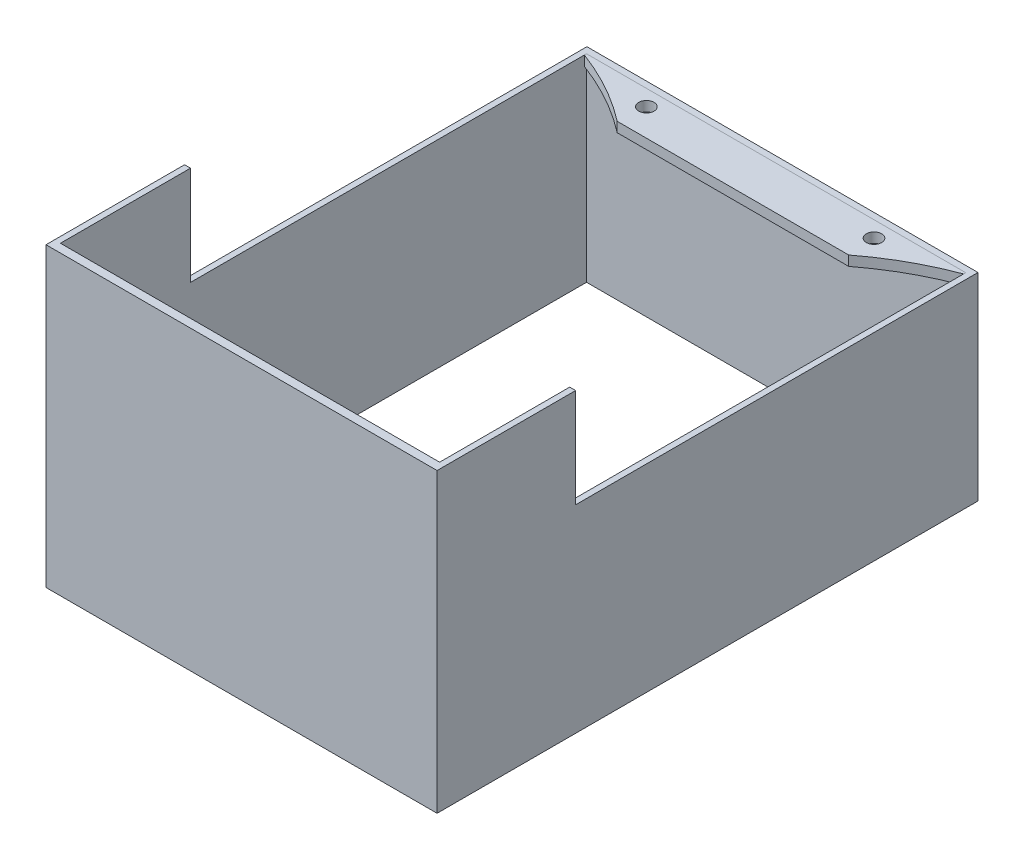
ISO-10303-21;
HEADER;
FILE_DESCRIPTION(('STEP AP214'),'2;1');
FILE_NAME('part.step','',(''),(''),'','','');
FILE_SCHEMA(('AUTOMOTIVE_DESIGN { 1 0 10303 214 1 1 1 1 }'));
ENDSEC;
DATA;
#1=APPLICATION_CONTEXT('core data for automotive mechanical design processes');
#2=APPLICATION_PROTOCOL_DEFINITION('international standard','automotive_design',2000,#1);
#3=PRODUCT_CONTEXT('',#1,'mechanical');
#4=PRODUCT('Part','Part','',(#3));
#5=PRODUCT_RELATED_PRODUCT_CATEGORY('part','',(#4));
#6=PRODUCT_DEFINITION_FORMATION('','',#4);
#7=PRODUCT_DEFINITION_CONTEXT('part definition',#1,'design');
#8=PRODUCT_DEFINITION('design','',#6,#7);
#9=PRODUCT_DEFINITION_SHAPE('','',#8);
#10=(LENGTH_UNIT() NAMED_UNIT(*) SI_UNIT(.MILLI.,.METRE.));
#11=(NAMED_UNIT(*) PLANE_ANGLE_UNIT() SI_UNIT($,.RADIAN.));
#12=(NAMED_UNIT(*) SI_UNIT($,.STERADIAN.) SOLID_ANGLE_UNIT());
#13=UNCERTAINTY_MEASURE_WITH_UNIT(LENGTH_MEASURE(1.E-05),#10,'distance_accuracy_value','');
#14=(GEOMETRIC_REPRESENTATION_CONTEXT(3) GLOBAL_UNCERTAINTY_ASSIGNED_CONTEXT((#13)) GLOBAL_UNIT_ASSIGNED_CONTEXT((#10,
#11,#12)) REPRESENTATION_CONTEXT('',''));
#15=CARTESIAN_POINT('',(0.,0.,0.));
#16=DIRECTION('',(0.,0.,1.));
#17=DIRECTION('',(1.,0.,0.));
#18=AXIS2_PLACEMENT_3D('',#15,#16,#17);
#19=CARTESIAN_POINT('',(-58.2500000000001,-8.,-8.5));
#20=DIRECTION('',(0.,0.,1.));
#21=DIRECTION('',(1.,0.,0.));
#22=AXIS2_PLACEMENT_3D('',#19,#20,#21);
#23=PLANE('',#22);
#24=DIRECTION('',(1.,0.,0.));
#25=VECTOR('',#24,1.);
#26=CARTESIAN_POINT('',(-58.2500000000001,2.,-8.5));
#27=LINE('',#26,#25);
#28=CARTESIAN_POINT('',(-39.52,2.,-8.50000000000001));
#29=VERTEX_POINT('',#28);
#30=CARTESIAN_POINT('',(39.52,2.,-8.50000000000001));
#31=VERTEX_POINT('',#30);
#32=EDGE_CURVE('E247',#29,#31,#27,.T.);
#33=ORIENTED_EDGE('',*,*,#32,.T.);
#34=DIRECTION('',(0.,1.,0.));
#35=VECTOR('',#34,1.);
#36=CARTESIAN_POINT('',(39.52,-8.,-8.50000000000001));
#37=LINE('',#36,#35);
#38=CARTESIAN_POINT('',(39.52,-38.,-8.50000000000001));
#39=VERTEX_POINT('',#38);
#40=EDGE_CURVE('E13',#39,#31,#37,.T.);
#41=ORIENTED_EDGE('',*,*,#40,.F.);
#42=DIRECTION('',(1.,0.,0.));
#43=VECTOR('',#42,1.);
#44=CARTESIAN_POINT('',(0.,-38.,-8.5));
#45=LINE('',#44,#43);
#46=CARTESIAN_POINT('',(-39.52,-38.,-8.50000000000001));
#47=VERTEX_POINT('',#46);
#48=EDGE_CURVE('E179',#47,#39,#45,.T.);
#49=ORIENTED_EDGE('',*,*,#48,.F.);
#50=DIRECTION('',(0.,1.,0.));
#51=VECTOR('',#50,1.);
#52=CARTESIAN_POINT('',(-39.52,-8.,-8.50000000000001));
#53=LINE('',#52,#51);
#54=EDGE_CURVE('E165',#47,#29,#53,.T.);
#55=ORIENTED_EDGE('',*,*,#54,.T.);
#56=EDGE_LOOP('',(#33,#41,#49,#55));
#57=FACE_BOUND('',#56,.T.);
#58=ADVANCED_FACE('F75',(#57),#23,.F.);
#59=CARTESIAN_POINT('',(39.52,-8.,46.4));
#60=DIRECTION('',(1.,0.,0.));
#61=DIRECTION('',(0.,0.,-1.));
#62=AXIS2_PLACEMENT_3D('',#59,#60,#61);
#63=PLANE('',#62);
#64=DIRECTION('',(0.,0.,-1.));
#65=VECTOR('',#64,1.);
#66=CARTESIAN_POINT('',(39.52,2.,46.4));
#67=LINE('',#66,#65);
#68=CARTESIAN_POINT('',(39.52,2.,72.8222176516292));
#69=VERTEX_POINT('',#68);
#70=EDGE_CURVE('E254',#69,#31,#67,.T.);
#71=ORIENTED_EDGE('',*,*,#70,.F.);
#72=DIRECTION('',(0.,-1.,0.));
#73=VECTOR('',#72,1.);
#74=CARTESIAN_POINT('',(39.52,22.,72.8222176516292));
#75=LINE('',#74,#73);
#76=CARTESIAN_POINT('',(39.52,22.,72.8222176516292));
#77=VERTEX_POINT('',#76);
#78=EDGE_CURVE('E89',#77,#69,#75,.T.);
#79=ORIENTED_EDGE('',*,*,#78,.F.);
#80=DIRECTION('',(0.,0.,-1.));
#81=VECTOR('',#80,1.);
#82=CARTESIAN_POINT('',(39.52,22.,0.));
#83=LINE('',#82,#81);
#84=CARTESIAN_POINT('',(39.52,22.,100.822217651629));
#85=VERTEX_POINT('',#84);
#86=EDGE_CURVE('E214',#85,#77,#83,.T.);
#87=ORIENTED_EDGE('',*,*,#86,.F.);
#88=DIRECTION('',(0.,1.,0.));
#89=VECTOR('',#88,1.);
#90=CARTESIAN_POINT('',(39.52,-8.,100.822217651629));
#91=LINE('',#90,#89);
#92=CARTESIAN_POINT('',(39.52,-38.,100.822217651629));
#93=VERTEX_POINT('',#92);
#94=EDGE_CURVE('E82',#93,#85,#91,.T.);
#95=ORIENTED_EDGE('',*,*,#94,.F.);
#96=DIRECTION('',(0.,0.,1.));
#97=VECTOR('',#96,1.);
#98=CARTESIAN_POINT('',(39.52,-38.,0.));
#99=LINE('',#98,#97);
#100=EDGE_CURVE('E183',#39,#93,#99,.T.);
#101=ORIENTED_EDGE('',*,*,#100,.F.);
#102=ORIENTED_EDGE('',*,*,#40,.T.);
#103=EDGE_LOOP('',(#71,#79,#87,#95,#101,#102));
#104=FACE_BOUND('',#103,.T.);
#105=ADVANCED_FACE('F267',(#104),#63,.T.);
#106=CARTESIAN_POINT('',(-58.2500000000001,-8.,100.822217651629));
#107=DIRECTION('',(0.,0.,-1.));
#108=DIRECTION('',(-1.,0.,0.));
#109=AXIS2_PLACEMENT_3D('',#106,#107,#108);
#110=PLANE('',#109);
#111=ORIENTED_EDGE('',*,*,#94,.T.);
#112=DIRECTION('',(1.,0.,0.));
#113=VECTOR('',#112,1.);
#114=CARTESIAN_POINT('',(0.,22.,100.822217651629));
#115=LINE('',#114,#113);
#116=CARTESIAN_POINT('',(-39.52,22.,100.822217651629));
#117=VERTEX_POINT('',#116);
#118=EDGE_CURVE('E210',#117,#85,#115,.T.);
#119=ORIENTED_EDGE('',*,*,#118,.F.);
#120=DIRECTION('',(0.,1.,0.));
#121=VECTOR('',#120,1.);
#122=CARTESIAN_POINT('',(-39.52,-8.,100.822217651629));
#123=LINE('',#122,#121);
#124=CARTESIAN_POINT('',(-39.52,-38.,100.822217651629));
#125=VERTEX_POINT('',#124);
#126=EDGE_CURVE('E176',#125,#117,#123,.T.);
#127=ORIENTED_EDGE('',*,*,#126,.F.);
#128=DIRECTION('',(-1.,0.,0.));
#129=VECTOR('',#128,1.);
#130=CARTESIAN_POINT('',(0.,-38.,100.822217651629));
#131=LINE('',#130,#129);
#132=EDGE_CURVE('E189',#93,#125,#131,.T.);
#133=ORIENTED_EDGE('',*,*,#132,.F.);
#134=EDGE_LOOP('',(#111,#119,#127,#133));
#135=FACE_BOUND('',#134,.T.);
#136=ADVANCED_FACE('F259',(#135),#110,.F.);
#137=CARTESIAN_POINT('',(-39.52,-8.,46.4));
#138=DIRECTION('',(1.,0.,0.));
#139=DIRECTION('',(0.,0.,-1.));
#140=AXIS2_PLACEMENT_3D('',#137,#138,#139);
#141=PLANE('',#140);
#142=ORIENTED_EDGE('',*,*,#126,.T.);
#143=DIRECTION('',(0.,0.,1.));
#144=VECTOR('',#143,1.);
#145=CARTESIAN_POINT('',(-39.52,22.,0.));
#146=LINE('',#145,#144);
#147=CARTESIAN_POINT('',(-39.52,22.,72.8222176516292));
#148=VERTEX_POINT('',#147);
#149=EDGE_CURVE('E207',#148,#117,#146,.T.);
#150=ORIENTED_EDGE('',*,*,#149,.F.);
#151=DIRECTION('',(0.,-1.,0.));
#152=VECTOR('',#151,1.);
#153=CARTESIAN_POINT('',(-39.52,22.,72.8222176516292));
#154=LINE('',#153,#152);
#155=CARTESIAN_POINT('',(-39.52,2.,72.8222176516292));
#156=VERTEX_POINT('',#155);
#157=EDGE_CURVE('E228',#148,#156,#154,.T.);
#158=ORIENTED_EDGE('',*,*,#157,.T.);
#159=DIRECTION('',(0.,0.,-1.));
#160=VECTOR('',#159,1.);
#161=CARTESIAN_POINT('',(-39.52,2.,46.4));
#162=LINE('',#161,#160);
#163=EDGE_CURVE('E172',#156,#29,#162,.T.);
#164=ORIENTED_EDGE('',*,*,#163,.T.);
#165=ORIENTED_EDGE('',*,*,#54,.F.);
#166=DIRECTION('',(0.,0.,-1.));
#167=VECTOR('',#166,1.);
#168=CARTESIAN_POINT('',(-39.52,-38.,0.));
#169=LINE('',#168,#167);
#170=EDGE_CURVE('E169',#125,#47,#169,.T.);
#171=ORIENTED_EDGE('',*,*,#170,.F.);
#172=EDGE_LOOP('',(#142,#150,#158,#164,#165,#171));
#173=FACE_BOUND('',#172,.T.);
#174=ADVANCED_FACE('F167',(#173),#141,.F.);
#175=CARTESIAN_POINT('',(0.,2.,0.));
#176=DIRECTION('',(0.,1.,0.));
#177=DIRECTION('',(0.,0.,1.));
#178=AXIS2_PLACEMENT_3D('',#175,#176,#177);
#179=PLANE('',#178);
#180=DIRECTION('',(-1.,0.,0.));
#181=VECTOR('',#180,1.);
#182=CARTESIAN_POINT('',(0.,2.,72.8222176516292));
#183=LINE('',#182,#181);
#184=CARTESIAN_POINT('',(-38.32,2.,72.8222176516292));
#185=VERTEX_POINT('',#184);
#186=EDGE_CURVE('E211',#185,#156,#183,.T.);
#187=ORIENTED_EDGE('',*,*,#186,.F.);
#188=DIRECTION('',(0.,0.,1.));
#189=VECTOR('',#188,1.);
#190=CARTESIAN_POINT('',(-38.32,2.,46.4));
#191=LINE('',#190,#189);
#192=CARTESIAN_POINT('',(-38.32,2.,-7.22221765162924));
#193=VERTEX_POINT('',#192);
#194=EDGE_CURVE('E238',#193,#185,#191,.T.);
#195=ORIENTED_EDGE('',*,*,#194,.F.);
#196=DIRECTION('',(-1.,0.,0.));
#197=VECTOR('',#196,1.);
#198=CARTESIAN_POINT('',(-58.2500000000001,2.,-7.22221765162924));
#199=LINE('',#198,#197);
#200=CARTESIAN_POINT('',(38.32,2.,-7.22221765162924));
#201=VERTEX_POINT('',#200);
#202=EDGE_CURVE('E97',#201,#193,#199,.T.);
#203=ORIENTED_EDGE('',*,*,#202,.F.);
#204=DIRECTION('',(0.,0.,1.));
#205=VECTOR('',#204,1.);
#206=CARTESIAN_POINT('',(38.32,2.,46.4));
#207=LINE('',#206,#205);
#208=CARTESIAN_POINT('',(38.32,2.,72.8222176516292));
#209=VERTEX_POINT('',#208);
#210=EDGE_CURVE('E241',#201,#209,#207,.T.);
#211=ORIENTED_EDGE('',*,*,#210,.T.);
#212=DIRECTION('',(1.,0.,0.));
#213=VECTOR('',#212,1.);
#214=CARTESIAN_POINT('',(0.,2.,72.8222176516292));
#215=LINE('',#214,#213);
#216=EDGE_CURVE('E206',#209,#69,#215,.T.);
#217=ORIENTED_EDGE('',*,*,#216,.T.);
#218=ORIENTED_EDGE('',*,*,#70,.T.);
#219=ORIENTED_EDGE('',*,*,#32,.F.);
#220=ORIENTED_EDGE('',*,*,#163,.F.);
#221=EDGE_LOOP('',(#187,#195,#203,#211,#217,#218,#219,#220));
#222=FACE_BOUND('',#221,.T.);
#223=ADVANCED_FACE('F287',(#222),#179,.T.);
#224=CARTESIAN_POINT('',(-58.2500000000001,-8.,-7.22221765162924));
#225=DIRECTION('',(0.,0.,-1.));
#226=DIRECTION('',(-1.,0.,0.));
#227=AXIS2_PLACEMENT_3D('',#224,#225,#226);
#228=PLANE('',#227);
#229=ORIENTED_EDGE('',*,*,#202,.T.);
#230=DIRECTION('',(0.,1.,0.));
#231=VECTOR('',#230,1.);
#232=CARTESIAN_POINT('',(-38.32,-8.,-7.22221765162924));
#233=LINE('',#232,#231);
#234=CARTESIAN_POINT('',(-38.32,-38.,-7.22221765162924));
#235=VERTEX_POINT('',#234);
#236=EDGE_CURVE('E244',#235,#193,#233,.T.);
#237=ORIENTED_EDGE('',*,*,#236,.F.);
#238=DIRECTION('',(-1.,0.,0.));
#239=VECTOR('',#238,1.);
#240=CARTESIAN_POINT('',(0.,-38.,-7.22221765162924));
#241=LINE('',#240,#239);
#242=CARTESIAN_POINT('',(38.32,-38.,-7.22221765162924));
#243=VERTEX_POINT('',#242);
#244=EDGE_CURVE('E200',#243,#235,#241,.T.);
#245=ORIENTED_EDGE('',*,*,#244,.F.);
#246=DIRECTION('',(0.,1.,0.));
#247=VECTOR('',#246,1.);
#248=CARTESIAN_POINT('',(38.32,-8.,-7.22221765162924));
#249=LINE('',#248,#247);
#250=EDGE_CURVE('E245',#243,#201,#249,.T.);
#251=ORIENTED_EDGE('',*,*,#250,.T.);
#252=EDGE_LOOP('',(#229,#237,#245,#251));
#253=FACE_BOUND('',#252,.T.);
#254=ADVANCED_FACE('F282',(#253),#228,.F.);
#255=CARTESIAN_POINT('',(38.32,-8.,46.4));
#256=DIRECTION('',(-1.,0.,0.));
#257=DIRECTION('',(0.,0.,1.));
#258=AXIS2_PLACEMENT_3D('',#255,#256,#257);
#259=PLANE('',#258);
#260=ORIENTED_EDGE('',*,*,#210,.F.);
#261=ORIENTED_EDGE('',*,*,#250,.F.);
#262=DIRECTION('',(0.,0.,-1.));
#263=VECTOR('',#262,1.);
#264=CARTESIAN_POINT('',(38.32,-38.,0.));
#265=LINE('',#264,#263);
#266=CARTESIAN_POINT('',(38.32,-38.,99.1067873224881));
#267=VERTEX_POINT('',#266);
#268=EDGE_CURVE('E197',#267,#243,#265,.T.);
#269=ORIENTED_EDGE('',*,*,#268,.F.);
#270=DIRECTION('',(0.,1.,0.));
#271=VECTOR('',#270,1.);
#272=CARTESIAN_POINT('',(38.32,-8.,99.1067873224881));
#273=LINE('',#272,#271);
#274=CARTESIAN_POINT('',(38.32,22.,99.1067873224881));
#275=VERTEX_POINT('',#274);
#276=EDGE_CURVE('E248',#267,#275,#273,.T.);
#277=ORIENTED_EDGE('',*,*,#276,.T.);
#278=DIRECTION('',(0.,0.,1.));
#279=VECTOR('',#278,1.);
#280=CARTESIAN_POINT('',(38.32,22.,0.));
#281=LINE('',#280,#279);
#282=CARTESIAN_POINT('',(38.32,22.,72.8222176516292));
#283=VERTEX_POINT('',#282);
#284=EDGE_CURVE('E218',#283,#275,#281,.T.);
#285=ORIENTED_EDGE('',*,*,#284,.F.);
#286=DIRECTION('',(0.,-1.,0.));
#287=VECTOR('',#286,1.);
#288=CARTESIAN_POINT('',(38.32,22.,72.8222176516292));
#289=LINE('',#288,#287);
#290=EDGE_CURVE('E234',#283,#209,#289,.T.);
#291=ORIENTED_EDGE('',*,*,#290,.T.);
#292=EDGE_LOOP('',(#260,#261,#269,#277,#285,#291));
#293=FACE_BOUND('',#292,.T.);
#294=ADVANCED_FACE('F315',(#293),#259,.T.);
#295=CARTESIAN_POINT('',(-58.2500000000001,-8.,99.1067873224881));
#296=DIRECTION('',(0.,0.,-1.));
#297=DIRECTION('',(-1.,0.,0.));
#298=AXIS2_PLACEMENT_3D('',#295,#296,#297);
#299=PLANE('',#298);
#300=DIRECTION('',(0.,1.,0.));
#301=VECTOR('',#300,1.);
#302=CARTESIAN_POINT('',(-38.32,-8.,99.1067873224881));
#303=LINE('',#302,#301);
#304=CARTESIAN_POINT('',(-38.32,-38.,99.1067873224881));
#305=VERTEX_POINT('',#304);
#306=CARTESIAN_POINT('',(-38.32,22.,99.1067873224881));
#307=VERTEX_POINT('',#306);
#308=EDGE_CURVE('E250',#305,#307,#303,.T.);
#309=ORIENTED_EDGE('',*,*,#308,.T.);
#310=DIRECTION('',(-1.,0.,0.));
#311=VECTOR('',#310,1.);
#312=CARTESIAN_POINT('',(0.,22.,99.1067873224881));
#313=LINE('',#312,#311);
#314=EDGE_CURVE('E221',#275,#307,#313,.T.);
#315=ORIENTED_EDGE('',*,*,#314,.F.);
#316=ORIENTED_EDGE('',*,*,#276,.F.);
#317=DIRECTION('',(1.,0.,0.));
#318=VECTOR('',#317,1.);
#319=CARTESIAN_POINT('',(0.,-38.,99.1067873224881));
#320=LINE('',#319,#318);
#321=EDGE_CURVE('E194',#305,#267,#320,.T.);
#322=ORIENTED_EDGE('',*,*,#321,.F.);
#323=EDGE_LOOP('',(#309,#315,#316,#322));
#324=FACE_BOUND('',#323,.T.);
#325=ADVANCED_FACE('F274',(#324),#299,.T.);
#326=CARTESIAN_POINT('',(-38.32,-8.,46.4));
#327=DIRECTION('',(-1.,0.,0.));
#328=DIRECTION('',(0.,0.,1.));
#329=AXIS2_PLACEMENT_3D('',#326,#327,#328);
#330=PLANE('',#329);
#331=ORIENTED_EDGE('',*,*,#194,.T.);
#332=DIRECTION('',(0.,-1.,0.));
#333=VECTOR('',#332,1.);
#334=CARTESIAN_POINT('',(-38.32,22.,72.8222176516292));
#335=LINE('',#334,#333);
#336=CARTESIAN_POINT('',(-38.32,22.,72.8222176516292));
#337=VERTEX_POINT('',#336);
#338=EDGE_CURVE('E232',#337,#185,#335,.T.);
#339=ORIENTED_EDGE('',*,*,#338,.F.);
#340=DIRECTION('',(0.,0.,-1.));
#341=VECTOR('',#340,1.);
#342=CARTESIAN_POINT('',(-38.32,22.,0.));
#343=LINE('',#342,#341);
#344=EDGE_CURVE('E224',#307,#337,#343,.T.);
#345=ORIENTED_EDGE('',*,*,#344,.F.);
#346=ORIENTED_EDGE('',*,*,#308,.F.);
#347=DIRECTION('',(0.,0.,1.));
#348=VECTOR('',#347,1.);
#349=CARTESIAN_POINT('',(-38.32,-38.,0.));
#350=LINE('',#349,#348);
#351=EDGE_CURVE('E203',#235,#305,#350,.T.);
#352=ORIENTED_EDGE('',*,*,#351,.F.);
#353=ORIENTED_EDGE('',*,*,#236,.T.);
#354=EDGE_LOOP('',(#331,#339,#345,#346,#352,#353));
#355=FACE_BOUND('',#354,.T.);
#356=ADVANCED_FACE('F279',(#355),#330,.F.);
#357=CARTESIAN_POINT('',(0.,22.,72.8222176516292));
#358=DIRECTION('',(0.,0.,-1.));
#359=DIRECTION('',(-1.,0.,0.));
#360=AXIS2_PLACEMENT_3D('',#357,#358,#359);
#361=PLANE('',#360);
#362=ORIENTED_EDGE('',*,*,#216,.F.);
#363=ORIENTED_EDGE('',*,*,#290,.F.);
#364=DIRECTION('',(1.,0.,0.));
#365=VECTOR('',#364,1.);
#366=CARTESIAN_POINT('',(0.,22.,72.8222176516292));
#367=LINE('',#366,#365);
#368=EDGE_CURVE('E216',#283,#77,#367,.T.);
#369=ORIENTED_EDGE('',*,*,#368,.T.);
#370=ORIENTED_EDGE('',*,*,#78,.T.);
#371=EDGE_LOOP('',(#362,#363,#369,#370));
#372=FACE_BOUND('',#371,.T.);
#373=ADVANCED_FACE('F268',(#372),#361,.T.);
#374=CARTESIAN_POINT('',(0.,22.,72.8222176516292));
#375=DIRECTION('',(0.,0.,1.));
#376=DIRECTION('',(1.,0.,0.));
#377=AXIS2_PLACEMENT_3D('',#374,#375,#376);
#378=PLANE('',#377);
#379=ORIENTED_EDGE('',*,*,#186,.T.);
#380=ORIENTED_EDGE('',*,*,#157,.F.);
#381=DIRECTION('',(-1.,0.,0.));
#382=VECTOR('',#381,1.);
#383=CARTESIAN_POINT('',(0.,22.,72.8222176516292));
#384=LINE('',#383,#382);
#385=EDGE_CURVE('E226',#337,#148,#384,.T.);
#386=ORIENTED_EDGE('',*,*,#385,.F.);
#387=ORIENTED_EDGE('',*,*,#338,.T.);
#388=EDGE_LOOP('',(#379,#380,#386,#387));
#389=FACE_BOUND('',#388,.T.);
#390=ADVANCED_FACE('F290',(#389),#378,.F.);
#391=CARTESIAN_POINT('',(0.,22.,0.));
#392=DIRECTION('',(0.,1.,0.));
#393=DIRECTION('',(0.,0.,1.));
#394=AXIS2_PLACEMENT_3D('',#391,#392,#393);
#395=PLANE('',#394);
#396=ORIENTED_EDGE('',*,*,#149,.T.);
#397=ORIENTED_EDGE('',*,*,#118,.T.);
#398=ORIENTED_EDGE('',*,*,#86,.T.);
#399=ORIENTED_EDGE('',*,*,#368,.F.);
#400=ORIENTED_EDGE('',*,*,#284,.T.);
#401=ORIENTED_EDGE('',*,*,#314,.T.);
#402=ORIENTED_EDGE('',*,*,#344,.T.);
#403=ORIENTED_EDGE('',*,*,#385,.T.);
#404=EDGE_LOOP('',(#396,#397,#398,#399,#400,#401,#402,#403));
#405=FACE_BOUND('',#404,.T.);
#406=ADVANCED_FACE('F263',(#405),#395,.T.);
#407=CARTESIAN_POINT('',(0.,-38.,0.));
#408=DIRECTION('',(0.,-1.,0.));
#409=DIRECTION('',(0.,0.,-1.));
#410=AXIS2_PLACEMENT_3D('',#407,#408,#409);
#411=PLANE('',#410);
#412=ORIENTED_EDGE('',*,*,#170,.T.);
#413=ORIENTED_EDGE('',*,*,#48,.T.);
#414=ORIENTED_EDGE('',*,*,#100,.T.);
#415=ORIENTED_EDGE('',*,*,#132,.T.);
#416=EDGE_LOOP('',(#412,#413,#414,#415));
#417=FACE_BOUND('',#416,.T.);
#418=ORIENTED_EDGE('',*,*,#321,.T.);
#419=ORIENTED_EDGE('',*,*,#268,.T.);
#420=ORIENTED_EDGE('',*,*,#244,.T.);
#421=ORIENTED_EDGE('',*,*,#351,.T.);
#422=EDGE_LOOP('',(#418,#419,#420,#421));
#423=FACE_BOUND('',#422,.T.);
#424=ADVANCED_FACE('F186',(#417,#423),#411,.T.);
#425=CLOSED_SHELL('',(#58,#105,#136,#174,#223,#254,#294,#325,#356,#373,#390,#406,#424));
#426=MANIFOLD_SOLID_BREP('B2',#425);
#427=CARTESIAN_POINT('',(0.,2.,1.5));
#428=DIRECTION('',(0.,0.,-1.));
#429=DIRECTION('',(-1.,0.,0.));
#430=AXIS2_PLACEMENT_3D('',#427,#428,#429);
#431=PLANE('',#430);
#432=DIRECTION('',(1.,0.,0.));
#433=VECTOR('',#432,1.);
#434=CARTESIAN_POINT('',(0.,0.,1.5));
#435=LINE('',#434,#433);
#436=CARTESIAN_POINT('',(-23.3950805297993,0.,1.5));
#437=VERTEX_POINT('',#436);
#438=CARTESIAN_POINT('',(23.3950805297993,0.,1.5));
#439=VERTEX_POINT('',#438);
#440=EDGE_CURVE('E637',#437,#439,#435,.T.);
#441=ORIENTED_EDGE('',*,*,#440,.T.);
#442=DIRECTION('',(0.,-1.,0.));
#443=VECTOR('',#442,1.);
#444=CARTESIAN_POINT('',(23.3950805297993,2.,1.5));
#445=LINE('',#444,#443);
#446=CARTESIAN_POINT('',(23.3950805297993,2.,1.5));
#447=VERTEX_POINT('',#446);
#448=EDGE_CURVE('E73',#447,#439,#445,.T.);
#449=ORIENTED_EDGE('',*,*,#448,.F.);
#450=DIRECTION('',(1.,0.,0.));
#451=VECTOR('',#450,1.);
#452=CARTESIAN_POINT('',(0.,2.,1.5));
#453=LINE('',#452,#451);
#454=CARTESIAN_POINT('',(-23.3950805297993,2.,1.5));
#455=VERTEX_POINT('',#454);
#456=EDGE_CURVE('E805',#455,#447,#453,.T.);
#457=ORIENTED_EDGE('',*,*,#456,.F.);
#458=DIRECTION('',(0.,-1.,0.));
#459=VECTOR('',#458,1.);
#460=CARTESIAN_POINT('',(-23.3950805297993,2.,1.5));
#461=LINE('',#460,#459);
#462=EDGE_CURVE('E563',#455,#437,#461,.T.);
#463=ORIENTED_EDGE('',*,*,#462,.T.);
#464=EDGE_LOOP('',(#441,#449,#457,#463));
#465=FACE_BOUND('',#464,.T.);
#466=ADVANCED_FACE('F546',(#465),#431,.F.);
#467=CARTESIAN_POINT('',(58.32,2.,46.8));
#468=DIRECTION('',(0.,-1.,0.));
#469=DIRECTION('',(0.,0.,-1.));
#470=AXIS2_PLACEMENT_3D('',#467,#468,#469);
#471=CYLINDRICAL_SURFACE('',#470,57.2);
#472=CARTESIAN_POINT('',(58.32,0.,46.8));
#473=DIRECTION('',(0.,1.,0.));
#474=DIRECTION('',(0.,0.,1.));
#475=AXIS2_PLACEMENT_3D('',#472,#473,#474);
#476=CIRCLE('',#475,57.2);
#477=CARTESIAN_POINT('',(38.32,0.,-6.78955122036385));
#478=VERTEX_POINT('',#477);
#479=EDGE_CURVE('E639',#439,#478,#476,.F.);
#480=ORIENTED_EDGE('',*,*,#479,.T.);
#481=DIRECTION('',(0.,-1.,0.));
#482=VECTOR('',#481,1.);
#483=CARTESIAN_POINT('',(38.32,2.,-6.78955122036385));
#484=LINE('',#483,#482);
#485=CARTESIAN_POINT('',(38.32,2.,-6.78955122036385));
#486=VERTEX_POINT('',#485);
#487=EDGE_CURVE('E555',#486,#478,#484,.T.);
#488=ORIENTED_EDGE('',*,*,#487,.F.);
#489=CARTESIAN_POINT('',(58.32,2.,46.8));
#490=DIRECTION('',(0.,1.,0.));
#491=DIRECTION('',(0.,0.,1.));
#492=AXIS2_PLACEMENT_3D('',#489,#490,#491);
#493=CIRCLE('',#492,57.2);
#494=EDGE_CURVE('E595',#447,#486,#493,.F.);
#495=ORIENTED_EDGE('',*,*,#494,.F.);
#496=ORIENTED_EDGE('',*,*,#448,.T.);
#497=EDGE_LOOP('',(#480,#488,#495,#496));
#498=FACE_BOUND('',#497,.T.);
#499=ADVANCED_FACE('F673',(#498),#471,.F.);
#500=CARTESIAN_POINT('',(38.32,2.,0.));
#501=DIRECTION('',(-1.,0.,0.));
#502=DIRECTION('',(0.,0.,1.));
#503=AXIS2_PLACEMENT_3D('',#500,#501,#502);
#504=PLANE('',#503);
#505=DIRECTION('',(0.,0.,-1.));
#506=VECTOR('',#505,1.);
#507=CARTESIAN_POINT('',(38.32,0.,0.));
#508=LINE('',#507,#506);
#509=CARTESIAN_POINT('',(38.32,0.,-7.22221765162924));
#510=VERTEX_POINT('',#509);
#511=EDGE_CURVE('E641',#478,#510,#508,.T.);
#512=ORIENTED_EDGE('',*,*,#511,.T.);
#513=DIRECTION('',(0.,-1.,0.));
#514=VECTOR('',#513,1.);
#515=CARTESIAN_POINT('',(38.32,2.,-7.22221765162924));
#516=LINE('',#515,#514);
#517=CARTESIAN_POINT('',(38.32,2.,-7.22221765162924));
#518=VERTEX_POINT('',#517);
#519=EDGE_CURVE('E614',#518,#510,#516,.T.);
#520=ORIENTED_EDGE('',*,*,#519,.F.);
#521=DIRECTION('',(0.,0.,-1.));
#522=VECTOR('',#521,1.);
#523=CARTESIAN_POINT('',(38.32,2.,0.));
#524=LINE('',#523,#522);
#525=EDGE_CURVE('E622',#486,#518,#524,.T.);
#526=ORIENTED_EDGE('',*,*,#525,.F.);
#527=ORIENTED_EDGE('',*,*,#487,.T.);
#528=EDGE_LOOP('',(#512,#520,#526,#527));
#529=FACE_BOUND('',#528,.T.);
#530=ADVANCED_FACE('F656',(#529),#504,.F.);
#531=CARTESIAN_POINT('',(0.,2.,-7.22221765162924));
#532=DIRECTION('',(0.,0.,-1.));
#533=DIRECTION('',(-1.,0.,0.));
#534=AXIS2_PLACEMENT_3D('',#531,#532,#533);
#535=PLANE('',#534);
#536=DIRECTION('',(1.,0.,0.));
#537=VECTOR('',#536,1.);
#538=CARTESIAN_POINT('',(0.,0.,-7.22221765162924));
#539=LINE('',#538,#537);
#540=CARTESIAN_POINT('',(-38.32,0.,-7.22221765162924));
#541=VERTEX_POINT('',#540);
#542=EDGE_CURVE('E610',#541,#510,#539,.T.);
#543=ORIENTED_EDGE('',*,*,#542,.F.);
#544=DIRECTION('',(0.,-1.,0.));
#545=VECTOR('',#544,1.);
#546=CARTESIAN_POINT('',(-38.32,2.,-7.22221765162924));
#547=LINE('',#546,#545);
#548=CARTESIAN_POINT('',(-38.32,2.,-7.22221765162924));
#549=VERTEX_POINT('',#548);
#550=EDGE_CURVE('E605',#549,#541,#547,.T.);
#551=ORIENTED_EDGE('',*,*,#550,.F.);
#552=DIRECTION('',(1.,0.,0.));
#553=VECTOR('',#552,1.);
#554=CARTESIAN_POINT('',(0.,2.,-7.22221765162924));
#555=LINE('',#554,#553);
#556=EDGE_CURVE('E608',#549,#518,#555,.T.);
#557=ORIENTED_EDGE('',*,*,#556,.T.);
#558=ORIENTED_EDGE('',*,*,#519,.T.);
#559=EDGE_LOOP('',(#543,#551,#557,#558));
#560=FACE_BOUND('',#559,.T.);
#561=ADVANCED_FACE('F607',(#560),#535,.T.);
#562=CARTESIAN_POINT('',(-38.32,2.,0.));
#563=DIRECTION('',(-1.,0.,0.));
#564=DIRECTION('',(0.,0.,1.));
#565=AXIS2_PLACEMENT_3D('',#562,#563,#564);
#566=PLANE('',#565);
#567=DIRECTION('',(0.,0.,-1.));
#568=VECTOR('',#567,1.);
#569=CARTESIAN_POINT('',(-38.32,0.,0.));
#570=LINE('',#569,#568);
#571=CARTESIAN_POINT('',(-38.32,0.,-6.78955122036385));
#572=VERTEX_POINT('',#571);
#573=EDGE_CURVE('E645',#572,#541,#570,.T.);
#574=ORIENTED_EDGE('',*,*,#573,.F.);
#575=DIRECTION('',(0.,-1.,0.));
#576=VECTOR('',#575,1.);
#577=CARTESIAN_POINT('',(-38.32,2.,-6.78955122036385));
#578=LINE('',#577,#576);
#579=CARTESIAN_POINT('',(-38.32,2.,-6.78955122036385));
#580=VERTEX_POINT('',#579);
#581=EDGE_CURVE('E583',#580,#572,#578,.T.);
#582=ORIENTED_EDGE('',*,*,#581,.F.);
#583=DIRECTION('',(0.,0.,-1.));
#584=VECTOR('',#583,1.);
#585=CARTESIAN_POINT('',(-38.32,2.,0.));
#586=LINE('',#585,#584);
#587=EDGE_CURVE('E620',#580,#549,#586,.T.);
#588=ORIENTED_EDGE('',*,*,#587,.T.);
#589=ORIENTED_EDGE('',*,*,#550,.T.);
#590=EDGE_LOOP('',(#574,#582,#588,#589));
#591=FACE_BOUND('',#590,.T.);
#592=ADVANCED_FACE('F625',(#591),#566,.T.);
#593=CARTESIAN_POINT('',(23.,2.,-4.));
#594=DIRECTION('',(0.,-1.,0.));
#595=DIRECTION('',(0.,0.,-1.));
#596=AXIS2_PLACEMENT_3D('',#593,#594,#595);
#597=CYLINDRICAL_SURFACE('',#596,1.55);
#598=CARTESIAN_POINT('',(23.,2.,-4.));
#599=DIRECTION('',(0.,1.,0.));
#600=DIRECTION('',(0.,0.,1.));
#601=AXIS2_PLACEMENT_3D('',#598,#599,#600);
#602=CIRCLE('',#601,1.55);
#603=CARTESIAN_POINT('',(23.,2.,-2.45));
#604=VERTEX_POINT('',#603);
#605=EDGE_CURVE('E688',#604,#604,#602,.F.);
#606=ORIENTED_EDGE('',*,*,#605,.F.);
#607=EDGE_LOOP('',(#606));
#608=FACE_BOUND('',#607,.T.);
#609=CARTESIAN_POINT('',(23.,0.,-4.));
#610=DIRECTION('',(0.,1.,0.));
#611=DIRECTION('',(0.,0.,1.));
#612=AXIS2_PLACEMENT_3D('',#609,#610,#611);
#613=CIRCLE('',#612,1.55);
#614=CARTESIAN_POINT('',(23.,0.,-2.45));
#615=VERTEX_POINT('',#614);
#616=EDGE_CURVE('E634',#615,#615,#613,.F.);
#617=ORIENTED_EDGE('',*,*,#616,.T.);
#618=EDGE_LOOP('',(#617));
#619=FACE_BOUND('',#618,.T.);
#620=ADVANCED_FACE('F668',(#608,#619),#597,.F.);
#621=CARTESIAN_POINT('',(-23.,2.,-4.));
#622=DIRECTION('',(0.,-1.,0.));
#623=DIRECTION('',(0.,0.,-1.));
#624=AXIS2_PLACEMENT_3D('',#621,#622,#623);
#625=CYLINDRICAL_SURFACE('',#624,1.55);
#626=CARTESIAN_POINT('',(-23.,2.,-4.));
#627=DIRECTION('',(0.,1.,0.));
#628=DIRECTION('',(0.,0.,1.));
#629=AXIS2_PLACEMENT_3D('',#626,#627,#628);
#630=CIRCLE('',#629,1.55);
#631=CARTESIAN_POINT('',(-23.,2.,-2.45));
#632=VERTEX_POINT('',#631);
#633=EDGE_CURVE('E650',#632,#632,#630,.T.);
#634=ORIENTED_EDGE('',*,*,#633,.T.);
#635=EDGE_LOOP('',(#634));
#636=FACE_BOUND('',#635,.T.);
#637=CARTESIAN_POINT('',(-23.,0.,-4.));
#638=DIRECTION('',(0.,1.,0.));
#639=DIRECTION('',(0.,0.,1.));
#640=AXIS2_PLACEMENT_3D('',#637,#638,#639);
#641=CIRCLE('',#640,1.55);
#642=CARTESIAN_POINT('',(-23.,0.,-2.45));
#643=VERTEX_POINT('',#642);
#644=EDGE_CURVE('E631',#643,#643,#641,.T.);
#645=ORIENTED_EDGE('',*,*,#644,.F.);
#646=EDGE_LOOP('',(#645));
#647=FACE_BOUND('',#646,.T.);
#648=ADVANCED_FACE('F548',(#636,#647),#625,.F.);
#649=CARTESIAN_POINT('',(-58.32,2.,46.8));
#650=DIRECTION('',(0.,-1.,0.));
#651=DIRECTION('',(0.,0.,-1.));
#652=AXIS2_PLACEMENT_3D('',#649,#650,#651);
#653=CYLINDRICAL_SURFACE('',#652,57.2);
#654=CARTESIAN_POINT('',(-58.32,0.,46.8));
#655=DIRECTION('',(0.,1.,0.));
#656=DIRECTION('',(0.,0.,1.));
#657=AXIS2_PLACEMENT_3D('',#654,#655,#656);
#658=CIRCLE('',#657,57.2);
#659=EDGE_CURVE('E647',#437,#572,#658,.T.);
#660=ORIENTED_EDGE('',*,*,#659,.F.);
#661=ORIENTED_EDGE('',*,*,#462,.F.);
#662=CARTESIAN_POINT('',(-58.32,2.,46.8));
#663=DIRECTION('',(0.,1.,0.));
#664=DIRECTION('',(0.,0.,1.));
#665=AXIS2_PLACEMENT_3D('',#662,#663,#664);
#666=CIRCLE('',#665,57.2);
#667=EDGE_CURVE('E626',#455,#580,#666,.T.);
#668=ORIENTED_EDGE('',*,*,#667,.T.);
#669=ORIENTED_EDGE('',*,*,#581,.T.);
#670=EDGE_LOOP('',(#660,#661,#668,#669));
#671=FACE_BOUND('',#670,.T.);
#672=ADVANCED_FACE('F659',(#671),#653,.F.);
#673=CARTESIAN_POINT('',(0.,2.,0.));
#674=DIRECTION('',(0.,1.,0.));
#675=DIRECTION('',(0.,0.,1.));
#676=AXIS2_PLACEMENT_3D('',#673,#674,#675);
#677=PLANE('',#676);
#678=ORIENTED_EDGE('',*,*,#633,.F.);
#679=EDGE_LOOP('',(#678));
#680=FACE_BOUND('',#679,.T.);
#681=ORIENTED_EDGE('',*,*,#605,.T.);
#682=EDGE_LOOP('',(#681));
#683=FACE_BOUND('',#682,.T.);
#684=ORIENTED_EDGE('',*,*,#456,.T.);
#685=ORIENTED_EDGE('',*,*,#494,.T.);
#686=ORIENTED_EDGE('',*,*,#525,.T.);
#687=ORIENTED_EDGE('',*,*,#556,.F.);
#688=ORIENTED_EDGE('',*,*,#587,.F.);
#689=ORIENTED_EDGE('',*,*,#667,.F.);
#690=EDGE_LOOP('',(#684,#685,#686,#687,#688,#689));
#691=FACE_BOUND('',#690,.T.);
#692=ADVANCED_FACE('F618',(#680,#683,#691),#677,.T.);
#693=CARTESIAN_POINT('',(0.,0.,0.));
#694=DIRECTION('',(0.,1.,0.));
#695=DIRECTION('',(0.,0.,1.));
#696=AXIS2_PLACEMENT_3D('',#693,#694,#695);
#697=PLANE('',#696);
#698=ORIENTED_EDGE('',*,*,#644,.T.);
#699=EDGE_LOOP('',(#698));
#700=FACE_BOUND('',#699,.T.);
#701=ORIENTED_EDGE('',*,*,#616,.F.);
#702=EDGE_LOOP('',(#701));
#703=FACE_BOUND('',#702,.T.);
#704=ORIENTED_EDGE('',*,*,#440,.F.);
#705=ORIENTED_EDGE('',*,*,#659,.T.);
#706=ORIENTED_EDGE('',*,*,#573,.T.);
#707=ORIENTED_EDGE('',*,*,#542,.T.);
#708=ORIENTED_EDGE('',*,*,#511,.F.);
#709=ORIENTED_EDGE('',*,*,#479,.F.);
#710=EDGE_LOOP('',(#704,#705,#706,#707,#708,#709));
#711=FACE_BOUND('',#710,.T.);
#712=ADVANCED_FACE('F658',(#700,#703,#711),#697,.F.);
#713=CLOSED_SHELL('',(#466,#499,#530,#561,#592,#620,#648,#672,#692,#712));
#714=MANIFOLD_SOLID_BREP('B7',#713);
#715=ADVANCED_BREP_SHAPE_REPRESENTATION('',(#18,#426,#714),#14);
#716=SHAPE_DEFINITION_REPRESENTATION(#9,#715);
ENDSEC;
END-ISO-10303-21;
